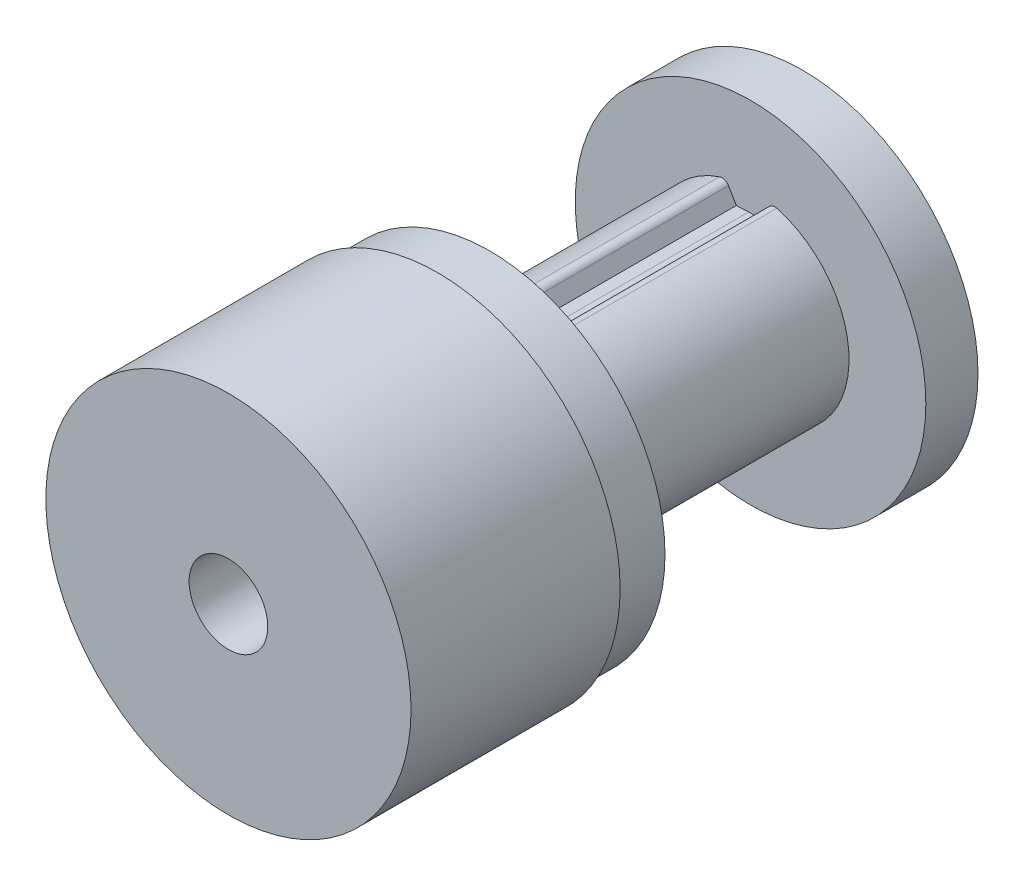
ISO-10303-21;
HEADER;
FILE_DESCRIPTION(('STEP AP214'),'2;1');
FILE_NAME('part.step','',(''),(''),'','','');
FILE_SCHEMA(('AUTOMOTIVE_DESIGN { 1 0 10303 214 1 1 1 1 }'));
ENDSEC;
DATA;
#1=APPLICATION_CONTEXT('core data for automotive mechanical design processes');
#2=APPLICATION_PROTOCOL_DEFINITION('international standard','automotive_design',2000,#1);
#3=PRODUCT_CONTEXT('',#1,'mechanical');
#4=PRODUCT('Part','Part','',(#3));
#5=PRODUCT_RELATED_PRODUCT_CATEGORY('part','',(#4));
#6=PRODUCT_DEFINITION_FORMATION('','',#4);
#7=PRODUCT_DEFINITION_CONTEXT('part definition',#1,'design');
#8=PRODUCT_DEFINITION('design','',#6,#7);
#9=PRODUCT_DEFINITION_SHAPE('','',#8);
#10=(LENGTH_UNIT() NAMED_UNIT(*) SI_UNIT(.MILLI.,.METRE.));
#11=(NAMED_UNIT(*) PLANE_ANGLE_UNIT() SI_UNIT($,.RADIAN.));
#12=(NAMED_UNIT(*) SI_UNIT($,.STERADIAN.) SOLID_ANGLE_UNIT());
#13=UNCERTAINTY_MEASURE_WITH_UNIT(LENGTH_MEASURE(1.E-05),#10,'distance_accuracy_value','');
#14=(GEOMETRIC_REPRESENTATION_CONTEXT(3) GLOBAL_UNCERTAINTY_ASSIGNED_CONTEXT((#13)) GLOBAL_UNIT_ASSIGNED_CONTEXT((#10,
#11,#12)) REPRESENTATION_CONTEXT('',''));
#15=CARTESIAN_POINT('',(0.,0.,0.));
#16=DIRECTION('',(0.,0.,1.));
#17=DIRECTION('',(1.,0.,0.));
#18=AXIS2_PLACEMENT_3D('',#15,#16,#17);
#19=CARTESIAN_POINT('',(0.,0.,11.91895));
#20=DIRECTION('',(0.,0.,1.));
#21=DIRECTION('',(1.,0.,0.));
#22=AXIS2_PLACEMENT_3D('',#19,#20,#21);
#23=PLANE('',#22);
#24=CARTESIAN_POINT('',(0.,0.,11.91895));
#25=DIRECTION('',(0.,0.,1.));
#26=DIRECTION('',(1.,0.,0.));
#27=AXIS2_PLACEMENT_3D('',#24,#25,#26);
#28=CIRCLE('',#27,1.19634);
#29=CARTESIAN_POINT('',(1.19634,0.,11.91895));
#30=VERTEX_POINT('',#29);
#31=EDGE_CURVE('E134',#30,#30,#28,.F.);
#32=ORIENTED_EDGE('',*,*,#31,.T.);
#33=EDGE_LOOP('',(#32));
#34=FACE_BOUND('',#33,.T.);
#35=CARTESIAN_POINT('',(0.,0.,11.91895));
#36=DIRECTION('',(0.,0.,1.));
#37=DIRECTION('',(1.,0.,0.));
#38=AXIS2_PLACEMENT_3D('',#35,#36,#37);
#39=CIRCLE('',#38,5.55625);
#40=CARTESIAN_POINT('',(5.55625,0.,11.91895));
#41=VERTEX_POINT('',#40);
#42=EDGE_CURVE('E22',#41,#41,#39,.F.);
#43=ORIENTED_EDGE('',*,*,#42,.F.);
#44=EDGE_LOOP('',(#43));
#45=FACE_BOUND('',#44,.T.);
#46=ADVANCED_FACE('F18',(#34,#45),#23,.T.);
#47=CARTESIAN_POINT('',(0.,0.,5.238115));
#48=DIRECTION('',(0.,0.,1.));
#49=DIRECTION('',(1.,0.,0.));
#50=AXIS2_PLACEMENT_3D('',#47,#48,#49);
#51=CYLINDRICAL_SURFACE('',#50,5.55625);
#52=ORIENTED_EDGE('',*,*,#42,.T.);
#53=EDGE_LOOP('',(#52));
#54=FACE_BOUND('',#53,.T.);
#55=CARTESIAN_POINT('',(0.,0.,5.55625));
#56=DIRECTION('',(0.,0.,1.));
#57=DIRECTION('',(1.,0.,0.));
#58=AXIS2_PLACEMENT_3D('',#55,#56,#57);
#59=CIRCLE('',#58,5.55625);
#60=CARTESIAN_POINT('',(5.55625,0.,5.55625));
#61=VERTEX_POINT('',#60);
#62=EDGE_CURVE('E132',#61,#61,#59,.T.);
#63=ORIENTED_EDGE('',*,*,#62,.T.);
#64=EDGE_LOOP('',(#63));
#65=FACE_BOUND('',#64,.T.);
#66=ADVANCED_FACE('F141',(#54,#65),#51,.T.);
#67=CARTESIAN_POINT('',(0.,0.,-6.111875));
#68=DIRECTION('',(0.,0.,1.));
#69=DIRECTION('',(1.,0.,0.));
#70=AXIS2_PLACEMENT_3D('',#67,#68,#69);
#71=CYLINDRICAL_SURFACE('',#70,1.19634);
#72=ORIENTED_EDGE('',*,*,#31,.F.);
#73=EDGE_LOOP('',(#72));
#74=FACE_BOUND('',#73,.T.);
#75=CARTESIAN_POINT('',(0.,0.,-5.55625));
#76=DIRECTION('',(0.,0.,1.));
#77=DIRECTION('',(1.,0.,0.));
#78=AXIS2_PLACEMENT_3D('',#75,#76,#77);
#79=CIRCLE('',#78,1.19634);
#80=CARTESIAN_POINT('',(1.19634,0.,-5.55625));
#81=VERTEX_POINT('',#80);
#82=EDGE_CURVE('E127',#81,#81,#79,.F.);
#83=ORIENTED_EDGE('',*,*,#82,.T.);
#84=EDGE_LOOP('',(#83));
#85=FACE_BOUND('',#84,.T.);
#86=ADVANCED_FACE('F149',(#74,#85),#71,.F.);
#87=CARTESIAN_POINT('',(0.,0.,5.55625));
#88=DIRECTION('',(0.,0.,1.));
#89=DIRECTION('',(1.,0.,0.));
#90=AXIS2_PLACEMENT_3D('',#87,#88,#89);
#91=PLANE('',#90);
#92=CARTESIAN_POINT('',(0.,0.,5.55625));
#93=DIRECTION('',(0.,0.,1.));
#94=DIRECTION('',(1.,0.,0.));
#95=AXIS2_PLACEMENT_3D('',#92,#93,#94);
#96=CIRCLE('',#95,5.334);
#97=CARTESIAN_POINT('',(5.334,0.,5.55625));
#98=VERTEX_POINT('',#97);
#99=EDGE_CURVE('E124',#98,#98,#96,.F.);
#100=ORIENTED_EDGE('',*,*,#99,.F.);
#101=EDGE_LOOP('',(#100));
#102=FACE_BOUND('',#101,.T.);
#103=ORIENTED_EDGE('',*,*,#62,.F.);
#104=EDGE_LOOP('',(#103));
#105=FACE_BOUND('',#104,.T.);
#106=ADVANCED_FACE('F194',(#102,#105),#91,.F.);
#107=CARTESIAN_POINT('',(-0.431255097134512,2.34410198822404,3.96875));
#108=DIRECTION('',(0.0483133795255113,-0.998832226832326,0.));
#109=DIRECTION('',(0.998832226832326,0.0483133795255113,0.));
#110=AXIS2_PLACEMENT_3D('',#107,#108,#109);
#111=PLANE('',#110);
#112=DIRECTION('',(0.,0.,1.));
#113=VECTOR('',#112,1.);
#114=CARTESIAN_POINT('',(-0.431255097134011,2.34410198822433,3.96875));
#115=LINE('',#114,#113);
#116=CARTESIAN_POINT('',(-0.431255097134007,2.34410198822424,-3.96875));
#117=VERTEX_POINT('',#116);
#118=CARTESIAN_POINT('',(-0.431255097134345,2.34410198822414,3.96875));
#119=VERTEX_POINT('',#118);
#120=EDGE_CURVE('E123',#117,#119,#115,.T.);
#121=ORIENTED_EDGE('',*,*,#120,.T.);
#122=DIRECTION('',(0.998832226832326,0.0483133795255113,0.));
#123=VECTOR('',#122,1.);
#124=CARTESIAN_POINT('',(-0.431255097134512,2.34410198822404,3.96875));
#125=LINE('',#124,#123);
#126=CARTESIAN_POINT('',(-0.0570962703038031,2.36220000000002,3.96875));
#127=VERTEX_POINT('',#126);
#128=EDGE_CURVE('E96',#127,#119,#125,.F.);
#129=ORIENTED_EDGE('',*,*,#128,.F.);
#130=DIRECTION('',(0.,0.,-1.));
#131=VECTOR('',#130,1.);
#132=CARTESIAN_POINT('',(-0.057096270303802,2.3622,3.96875));
#133=LINE('',#132,#131);
#134=CARTESIAN_POINT('',(-0.0570962703038031,2.36220000000002,-3.96875));
#135=VERTEX_POINT('',#134);
#136=EDGE_CURVE('E130',#127,#135,#133,.T.);
#137=ORIENTED_EDGE('',*,*,#136,.T.);
#138=DIRECTION('',(0.998832226832326,0.0483133795255113,0.));
#139=VECTOR('',#138,1.);
#140=CARTESIAN_POINT('',(-0.431255097134512,2.34410198822404,-3.96875));
#141=LINE('',#140,#139);
#142=EDGE_CURVE('E131',#117,#135,#141,.T.);
#143=ORIENTED_EDGE('',*,*,#142,.F.);
#144=EDGE_LOOP('',(#121,#129,#137,#143));
#145=FACE_BOUND('',#144,.T.);
#146=ADVANCED_FACE('F186',(#145),#111,.F.);
#147=CARTESIAN_POINT('',(0.,0.,-5.55625));
#148=DIRECTION('',(0.,0.,1.));
#149=DIRECTION('',(1.,0.,0.));
#150=AXIS2_PLACEMENT_3D('',#147,#148,#149);
#151=PLANE('',#150);
#152=ORIENTED_EDGE('',*,*,#82,.F.);
#153=EDGE_LOOP('',(#152));
#154=FACE_BOUND('',#153,.T.);
#155=CARTESIAN_POINT('',(0.,0.,-5.55625));
#156=DIRECTION('',(0.,0.,1.));
#157=DIRECTION('',(1.,0.,0.));
#158=AXIS2_PLACEMENT_3D('',#155,#156,#157);
#159=CIRCLE('',#158,5.334);
#160=CARTESIAN_POINT('',(5.334,0.,-5.55625));
#161=VERTEX_POINT('',#160);
#162=EDGE_CURVE('E120',#161,#161,#159,.T.);
#163=ORIENTED_EDGE('',*,*,#162,.F.);
#164=EDGE_LOOP('',(#163));
#165=FACE_BOUND('',#164,.T.);
#166=ADVANCED_FACE('F183',(#154,#165),#151,.F.);
#167=CARTESIAN_POINT('',(-0.3175,2.3622,3.96875));
#168=DIRECTION('',(0.,-1.,0.));
#169=DIRECTION('',(0.,0.,-1.));
#170=AXIS2_PLACEMENT_3D('',#167,#168,#169);
#171=PLANE('',#170);
#172=DIRECTION('',(0.,0.,1.));
#173=VECTOR('',#172,1.);
#174=CARTESIAN_POINT('',(0.3175,2.3622,3.96875));
#175=LINE('',#174,#173);
#176=CARTESIAN_POINT('',(0.3175,2.3622,3.96875));
#177=VERTEX_POINT('',#176);
#178=CARTESIAN_POINT('',(0.3175,2.3622,-3.96875));
#179=VERTEX_POINT('',#178);
#180=EDGE_CURVE('E119',#177,#179,#175,.F.);
#181=ORIENTED_EDGE('',*,*,#180,.T.);
#182=DIRECTION('',(1.,0.,0.));
#183=VECTOR('',#182,1.);
#184=CARTESIAN_POINT('',(-0.3175,2.3622,-3.96875));
#185=LINE('',#184,#183);
#186=EDGE_CURVE('E237',#135,#179,#185,.T.);
#187=ORIENTED_EDGE('',*,*,#186,.F.);
#188=ORIENTED_EDGE('',*,*,#136,.F.);
#189=DIRECTION('',(1.,0.,0.));
#190=VECTOR('',#189,1.);
#191=CARTESIAN_POINT('',(-0.3175,2.3622,3.96875));
#192=LINE('',#191,#190);
#193=EDGE_CURVE('E90',#177,#127,#192,.F.);
#194=ORIENTED_EDGE('',*,*,#193,.F.);
#195=EDGE_LOOP('',(#181,#187,#188,#194));
#196=FACE_BOUND('',#195,.T.);
#197=ADVANCED_FACE('F185',(#196),#171,.F.);
#198=CARTESIAN_POINT('',(0.,0.,-6.111875));
#199=DIRECTION('',(0.,0.,1.));
#200=DIRECTION('',(1.,0.,0.));
#201=AXIS2_PLACEMENT_3D('',#198,#199,#200);
#202=CYLINDRICAL_SURFACE('',#201,5.334);
#203=CARTESIAN_POINT('',(0.,0.,3.96875));
#204=DIRECTION('',(0.,0.,1.));
#205=DIRECTION('',(1.,0.,0.));
#206=AXIS2_PLACEMENT_3D('',#203,#204,#205);
#207=CIRCLE('',#206,5.334);
#208=CARTESIAN_POINT('',(5.334,0.,3.96875));
#209=VERTEX_POINT('',#208);
#210=EDGE_CURVE('E116',#209,#209,#207,.T.);
#211=ORIENTED_EDGE('',*,*,#210,.T.);
#212=EDGE_LOOP('',(#211));
#213=FACE_BOUND('',#212,.T.);
#214=ORIENTED_EDGE('',*,*,#99,.T.);
#215=EDGE_LOOP('',(#214));
#216=FACE_BOUND('',#215,.T.);
#217=ADVANCED_FACE('F191',(#213,#216),#202,.T.);
#218=CARTESIAN_POINT('',(-0.67069379157519,2.74625500567052,3.96875));
#219=DIRECTION('',(-0.859234752562217,-0.51158150864681,0.));
#220=DIRECTION('',(0.51158150864681,-0.859234752562217,0.));
#221=AXIS2_PLACEMENT_3D('',#218,#219,#220);
#222=PLANE('',#221);
#223=DIRECTION('',(0.51158150864681,-0.859234752562217,0.));
#224=VECTOR('',#223,1.);
#225=CARTESIAN_POINT('',(-0.67069379157519,2.74625500567052,-3.96875));
#226=LINE('',#225,#224);
#227=CARTESIAN_POINT('',(-0.670693791575191,2.74625500566952,-3.96875));
#228=VERTEX_POINT('',#227);
#229=EDGE_CURVE('E104',#228,#117,#226,.T.);
#230=ORIENTED_EDGE('',*,*,#229,.F.);
#231=DIRECTION('',(0.,0.,1.));
#232=VECTOR('',#231,1.);
#233=CARTESIAN_POINT('',(-0.67069379157607,2.74625500567,3.96875));
#234=LINE('',#233,#232);
#235=CARTESIAN_POINT('',(-0.670693791575118,2.7462550056694,3.96875));
#236=VERTEX_POINT('',#235);
#237=EDGE_CURVE('E102',#236,#228,#234,.F.);
#238=ORIENTED_EDGE('',*,*,#237,.F.);
#239=DIRECTION('',(0.51158150864574,-0.859234752562854,0.));
#240=VECTOR('',#239,1.);
#241=CARTESIAN_POINT('',(-0.67069379157519,2.74625500567052,3.96875));
#242=LINE('',#241,#240);
#243=EDGE_CURVE('E92',#236,#119,#242,.T.);
#244=ORIENTED_EDGE('',*,*,#243,.T.);
#245=ORIENTED_EDGE('',*,*,#120,.F.);
#246=EDGE_LOOP('',(#230,#238,#244,#245));
#247=FACE_BOUND('',#246,.T.);
#248=ADVANCED_FACE('F103',(#247),#222,.F.);
#249=CARTESIAN_POINT('',(0.,0.,-6.111875));
#250=DIRECTION('',(0.,0.,1.));
#251=DIRECTION('',(1.,0.,0.));
#252=AXIS2_PLACEMENT_3D('',#249,#250,#251);
#253=CYLINDRICAL_SURFACE('',#252,5.334);
#254=CARTESIAN_POINT('',(0.,0.,-3.96875));
#255=DIRECTION('',(0.,0.,1.));
#256=DIRECTION('',(1.,0.,0.));
#257=AXIS2_PLACEMENT_3D('',#254,#255,#256);
#258=CIRCLE('',#257,5.334);
#259=CARTESIAN_POINT('',(5.334,0.,-3.96875));
#260=VERTEX_POINT('',#259);
#261=EDGE_CURVE('E107',#260,#260,#258,.T.);
#262=ORIENTED_EDGE('',*,*,#261,.F.);
#263=EDGE_LOOP('',(#262));
#264=FACE_BOUND('',#263,.T.);
#265=ORIENTED_EDGE('',*,*,#162,.T.);
#266=EDGE_LOOP('',(#265));
#267=FACE_BOUND('',#266,.T.);
#268=ADVANCED_FACE('F176',(#264,#267),#253,.T.);
#269=CARTESIAN_POINT('',(0.3175,2.3622,3.96875));
#270=DIRECTION('',(0.882947592858917,-0.469471562785909,0.));
#271=DIRECTION('',(0.469471562785909,0.882947592858917,0.));
#272=AXIS2_PLACEMENT_3D('',#269,#270,#271);
#273=PLANE('',#272);
#274=DIRECTION('',(0.469471562786314,0.882947592858702,0.));
#275=VECTOR('',#274,1.);
#276=CARTESIAN_POINT('',(0.3175,2.3622,-3.96875));
#277=LINE('',#276,#275);
#278=CARTESIAN_POINT('',(0.537229712998949,2.77545148646054,-3.96875));
#279=VERTEX_POINT('',#278);
#280=EDGE_CURVE('E169',#179,#279,#277,.T.);
#281=ORIENTED_EDGE('',*,*,#280,.F.);
#282=ORIENTED_EDGE('',*,*,#180,.F.);
#283=DIRECTION('',(0.469471562786314,0.882947592858702,0.));
#284=VECTOR('',#283,1.);
#285=CARTESIAN_POINT('',(0.3175,2.3622,3.96875));
#286=LINE('',#285,#284);
#287=CARTESIAN_POINT('',(0.537229712998949,2.77545148646054,3.96875));
#288=VERTEX_POINT('',#287);
#289=EDGE_CURVE('E68',#177,#288,#286,.T.);
#290=ORIENTED_EDGE('',*,*,#289,.T.);
#291=DIRECTION('',(0.,0.,1.));
#292=VECTOR('',#291,1.);
#293=CARTESIAN_POINT('',(0.537229712998152,2.77545148645997,3.96875));
#294=LINE('',#293,#292);
#295=EDGE_CURVE('E168',#279,#288,#294,.T.);
#296=ORIENTED_EDGE('',*,*,#295,.F.);
#297=EDGE_LOOP('',(#281,#282,#290,#296));
#298=FACE_BOUND('',#297,.T.);
#299=ADVANCED_FACE('F179',(#298),#273,.F.);
#300=CARTESIAN_POINT('',(0.,0.,3.96875));
#301=DIRECTION('',(0.,0.,1.));
#302=DIRECTION('',(1.,0.,0.));
#303=AXIS2_PLACEMENT_3D('',#300,#301,#302);
#304=PLANE('',#303);
#305=CARTESIAN_POINT('',(-0.867114856010914,2.62930747279186,3.96875));
#306=DIRECTION('',(0.,0.,1.));
#307=DIRECTION('',(1.,0.,0.));
#308=AXIS2_PLACEMENT_3D('',#305,#306,#307);
#309=CIRCLE('',#308,0.2286);
#310=CARTESIAN_POINT('',(-0.938710411729039,2.84640661236355,3.96875));
#311=VERTEX_POINT('',#310);
#312=EDGE_CURVE('E57',#311,#236,#309,.F.);
#313=ORIENTED_EDGE('',*,*,#312,.F.);
#314=CARTESIAN_POINT('',(0.,0.,3.96875));
#315=DIRECTION('',(0.,0.,1.));
#316=DIRECTION('',(1.,0.,0.));
#317=AXIS2_PLACEMENT_3D('',#314,#315,#316);
#318=CIRCLE('',#317,2.9972);
#319=CARTESIAN_POINT('',(0.800135271142536,2.88842368565861,3.96875));
#320=VERTEX_POINT('',#319);
#321=EDGE_CURVE('E61',#320,#311,#318,.F.);
#322=ORIENTED_EDGE('',*,*,#321,.F.);
#323=CARTESIAN_POINT('',(0.73907153272647,2.66813028720856,3.96875));
#324=DIRECTION('',(0.,0.,1.));
#325=DIRECTION('',(1.,0.,0.));
#326=AXIS2_PLACEMENT_3D('',#323,#324,#325);
#327=CIRCLE('',#326,0.2286);
#328=EDGE_CURVE('E166',#288,#320,#327,.F.);
#329=ORIENTED_EDGE('',*,*,#328,.F.);
#330=ORIENTED_EDGE('',*,*,#289,.F.);
#331=ORIENTED_EDGE('',*,*,#193,.T.);
#332=ORIENTED_EDGE('',*,*,#128,.T.);
#333=ORIENTED_EDGE('',*,*,#243,.F.);
#334=EDGE_LOOP('',(#313,#322,#329,#330,#331,#332,#333));
#335=FACE_BOUND('',#334,.T.);
#336=ORIENTED_EDGE('',*,*,#210,.F.);
#337=EDGE_LOOP('',(#336));
#338=FACE_BOUND('',#337,.T.);
#339=ADVANCED_FACE('F94',(#335,#338),#304,.F.);
#340=CARTESIAN_POINT('',(-0.867114856010914,2.62930747279186,3.96875));
#341=DIRECTION('',(0.,0.,1.));
#342=DIRECTION('',(1.,0.,0.));
#343=AXIS2_PLACEMENT_3D('',#340,#341,#342);
#344=CYLINDRICAL_SURFACE('',#343,0.2286);
#345=CARTESIAN_POINT('',(-0.867114856010914,2.62930747279186,-3.96875));
#346=DIRECTION('',(0.,0.,1.));
#347=DIRECTION('',(1.,0.,0.));
#348=AXIS2_PLACEMENT_3D('',#345,#346,#347);
#349=CIRCLE('',#348,0.2286);
#350=CARTESIAN_POINT('',(-0.938710411729039,2.84640661236355,-3.96875));
#351=VERTEX_POINT('',#350);
#352=EDGE_CURVE('E170',#351,#228,#349,.F.);
#353=ORIENTED_EDGE('',*,*,#352,.F.);
#354=DIRECTION('',(0.,0.,1.));
#355=VECTOR('',#354,1.);
#356=CARTESIAN_POINT('',(-0.938709327959996,2.84640696977802,-6.111875));
#357=LINE('',#356,#355);
#358=EDGE_CURVE('E111',#311,#351,#357,.F.);
#359=ORIENTED_EDGE('',*,*,#358,.F.);
#360=ORIENTED_EDGE('',*,*,#312,.T.);
#361=ORIENTED_EDGE('',*,*,#237,.T.);
#362=EDGE_LOOP('',(#353,#359,#360,#361));
#363=FACE_BOUND('',#362,.T.);
#364=ADVANCED_FACE('F109',(#363),#344,.T.);
#365=CARTESIAN_POINT('',(0.,0.,-3.96875));
#366=DIRECTION('',(0.,0.,1.));
#367=DIRECTION('',(1.,0.,0.));
#368=AXIS2_PLACEMENT_3D('',#365,#366,#367);
#369=PLANE('',#368);
#370=CARTESIAN_POINT('',(0.73907153272647,2.66813028720856,-3.96875));
#371=DIRECTION('',(0.,0.,1.));
#372=DIRECTION('',(1.,0.,0.));
#373=AXIS2_PLACEMENT_3D('',#370,#371,#372);
#374=CIRCLE('',#373,0.2286);
#375=CARTESIAN_POINT('',(0.800135270688122,2.88842368401873,-3.96875));
#376=VERTEX_POINT('',#375);
#377=EDGE_CURVE('E37',#376,#279,#374,.T.);
#378=ORIENTED_EDGE('',*,*,#377,.F.);
#379=CARTESIAN_POINT('',(0.,0.,-3.96875));
#380=DIRECTION('',(0.,0.,1.));
#381=DIRECTION('',(1.,0.,0.));
#382=AXIS2_PLACEMENT_3D('',#379,#380,#381);
#383=CIRCLE('',#382,2.9972);
#384=EDGE_CURVE('E28',#351,#376,#383,.T.);
#385=ORIENTED_EDGE('',*,*,#384,.F.);
#386=ORIENTED_EDGE('',*,*,#352,.T.);
#387=ORIENTED_EDGE('',*,*,#229,.T.);
#388=ORIENTED_EDGE('',*,*,#142,.T.);
#389=ORIENTED_EDGE('',*,*,#186,.T.);
#390=ORIENTED_EDGE('',*,*,#280,.T.);
#391=EDGE_LOOP('',(#378,#385,#386,#387,#388,#389,#390));
#392=FACE_BOUND('',#391,.T.);
#393=ORIENTED_EDGE('',*,*,#261,.T.);
#394=EDGE_LOOP('',(#393));
#395=FACE_BOUND('',#394,.T.);
#396=ADVANCED_FACE('F156',(#392,#395),#369,.T.);
#397=CARTESIAN_POINT('',(0.73907153272647,2.66813028720856,3.96875));
#398=DIRECTION('',(0.,0.,1.));
#399=DIRECTION('',(1.,0.,0.));
#400=AXIS2_PLACEMENT_3D('',#397,#398,#399);
#401=CYLINDRICAL_SURFACE('',#400,0.2286);
#402=ORIENTED_EDGE('',*,*,#328,.T.);
#403=DIRECTION('',(0.,0.,1.));
#404=VECTOR('',#403,1.);
#405=CARTESIAN_POINT('',(0.800135194963692,2.88842370676125,-6.111875));
#406=LINE('',#405,#404);
#407=EDGE_CURVE('E10',#376,#320,#406,.T.);
#408=ORIENTED_EDGE('',*,*,#407,.F.);
#409=ORIENTED_EDGE('',*,*,#377,.T.);
#410=ORIENTED_EDGE('',*,*,#295,.T.);
#411=EDGE_LOOP('',(#402,#408,#409,#410));
#412=FACE_BOUND('',#411,.T.);
#413=ADVANCED_FACE('F152',(#412),#401,.T.);
#414=CARTESIAN_POINT('',(0.,0.,-6.111875));
#415=DIRECTION('',(0.,0.,1.));
#416=DIRECTION('',(1.,0.,0.));
#417=AXIS2_PLACEMENT_3D('',#414,#415,#416);
#418=CYLINDRICAL_SURFACE('',#417,2.9972);
#419=ORIENTED_EDGE('',*,*,#384,.T.);
#420=ORIENTED_EDGE('',*,*,#407,.T.);
#421=ORIENTED_EDGE('',*,*,#321,.T.);
#422=ORIENTED_EDGE('',*,*,#358,.T.);
#423=EDGE_LOOP('',(#419,#420,#421,#422));
#424=FACE_BOUND('',#423,.T.);
#425=ADVANCED_FACE('F20',(#424),#418,.T.);
#426=CLOSED_SHELL('',(#46,#66,#86,#106,#146,#166,#197,#217,#248,#268,#299,#339,#364,#396,#413,#425));
#427=MANIFOLD_SOLID_BREP('B1',#426);
#428=ADVANCED_BREP_SHAPE_REPRESENTATION('',(#18,#427),#14);
#429=SHAPE_DEFINITION_REPRESENTATION(#9,#428);
ENDSEC;
END-ISO-10303-21;
